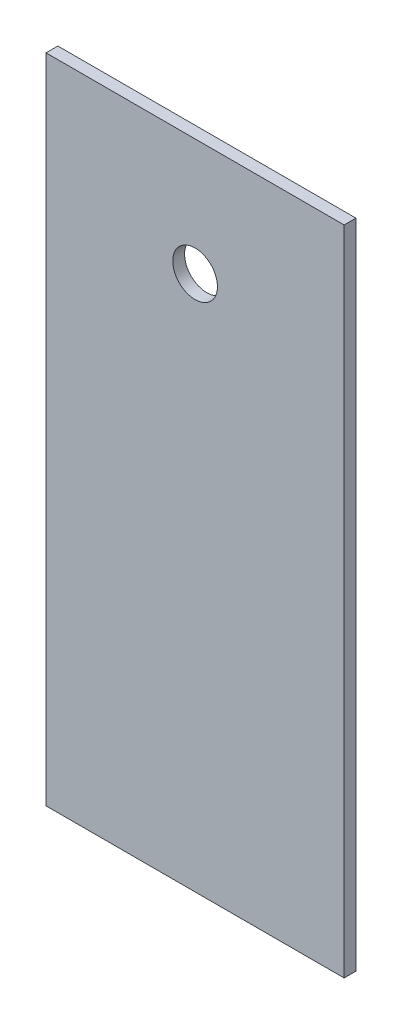
ISO-10303-21;
HEADER;
FILE_DESCRIPTION(('STEP AP214'),'2;1');
FILE_NAME('part.step','',(''),(''),'','','');
FILE_SCHEMA(('AUTOMOTIVE_DESIGN { 1 0 10303 214 1 1 1 1 }'));
ENDSEC;
DATA;
#1=APPLICATION_CONTEXT('core data for automotive mechanical design processes');
#2=APPLICATION_PROTOCOL_DEFINITION('international standard','automotive_design',2000,#1);
#3=PRODUCT_CONTEXT('',#1,'mechanical');
#4=PRODUCT('Part','Part','',(#3));
#5=PRODUCT_RELATED_PRODUCT_CATEGORY('part','',(#4));
#6=PRODUCT_DEFINITION_FORMATION('','',#4);
#7=PRODUCT_DEFINITION_CONTEXT('part definition',#1,'design');
#8=PRODUCT_DEFINITION('design','',#6,#7);
#9=PRODUCT_DEFINITION_SHAPE('','',#8);
#10=(LENGTH_UNIT() NAMED_UNIT(*) SI_UNIT(.MILLI.,.METRE.));
#11=(NAMED_UNIT(*) PLANE_ANGLE_UNIT() SI_UNIT($,.RADIAN.));
#12=(NAMED_UNIT(*) SI_UNIT($,.STERADIAN.) SOLID_ANGLE_UNIT());
#13=UNCERTAINTY_MEASURE_WITH_UNIT(LENGTH_MEASURE(1.E-05),#10,'distance_accuracy_value','');
#14=(GEOMETRIC_REPRESENTATION_CONTEXT(3) GLOBAL_UNCERTAINTY_ASSIGNED_CONTEXT((#13)) GLOBAL_UNIT_ASSIGNED_CONTEXT((#10,
#11,#12)) REPRESENTATION_CONTEXT('',''));
#15=CARTESIAN_POINT('',(0.,0.,0.));
#16=DIRECTION('',(0.,0.,1.));
#17=DIRECTION('',(1.,0.,0.));
#18=AXIS2_PLACEMENT_3D('',#15,#16,#17);
#19=CARTESIAN_POINT('',(40.,87.5,3.175));
#20=DIRECTION('',(-1.,0.,0.));
#21=DIRECTION('',(0.,-1.,0.));
#22=AXIS2_PLACEMENT_3D('',#19,#20,#21);
#23=PLANE('',#22);
#24=DIRECTION('',(0.,1.,0.));
#25=VECTOR('',#24,1.);
#26=CARTESIAN_POINT('',(40.,87.5,0.));
#27=LINE('',#26,#25);
#28=CARTESIAN_POINT('',(40.,-87.5,0.));
#29=VERTEX_POINT('',#28);
#30=CARTESIAN_POINT('',(40.,87.5,0.));
#31=VERTEX_POINT('',#30);
#32=EDGE_CURVE('E102',#29,#31,#27,.T.);
#33=ORIENTED_EDGE('',*,*,#32,.T.);
#34=DIRECTION('',(0.,0.,-1.));
#35=VECTOR('',#34,1.);
#36=CARTESIAN_POINT('',(40.,87.5,3.175));
#37=LINE('',#36,#35);
#38=CARTESIAN_POINT('',(40.,87.5,3.175));
#39=VERTEX_POINT('',#38);
#40=EDGE_CURVE('E11',#39,#31,#37,.T.);
#41=ORIENTED_EDGE('',*,*,#40,.F.);
#42=DIRECTION('',(0.,1.,0.));
#43=VECTOR('',#42,1.);
#44=CARTESIAN_POINT('',(40.,87.5,3.175));
#45=LINE('',#44,#43);
#46=CARTESIAN_POINT('',(40.,-87.5,3.175));
#47=VERTEX_POINT('',#46);
#48=EDGE_CURVE('E90',#47,#39,#45,.T.);
#49=ORIENTED_EDGE('',*,*,#48,.F.);
#50=DIRECTION('',(0.,0.,-1.));
#51=VECTOR('',#50,1.);
#52=CARTESIAN_POINT('',(40.,-87.5,3.175));
#53=LINE('',#52,#51);
#54=EDGE_CURVE('E98',#47,#29,#53,.T.);
#55=ORIENTED_EDGE('',*,*,#54,.T.);
#56=EDGE_LOOP('',(#33,#41,#49,#55));
#57=FACE_BOUND('',#56,.T.);
#58=ADVANCED_FACE('F39',(#57),#23,.F.);
#59=CARTESIAN_POINT('',(-40.,87.5,3.175));
#60=DIRECTION('',(0.,-1.,0.));
#61=DIRECTION('',(0.,0.,-1.));
#62=AXIS2_PLACEMENT_3D('',#59,#60,#61);
#63=PLANE('',#62);
#64=DIRECTION('',(-1.,0.,0.));
#65=VECTOR('',#64,1.);
#66=CARTESIAN_POINT('',(-40.,87.5,0.));
#67=LINE('',#66,#65);
#68=CARTESIAN_POINT('',(-40.,87.5,0.));
#69=VERTEX_POINT('',#68);
#70=EDGE_CURVE('E94',#31,#69,#67,.T.);
#71=ORIENTED_EDGE('',*,*,#70,.T.);
#72=DIRECTION('',(0.,0.,-1.));
#73=VECTOR('',#72,1.);
#74=CARTESIAN_POINT('',(-40.,87.5,3.175));
#75=LINE('',#74,#73);
#76=CARTESIAN_POINT('',(-40.,87.5,3.175));
#77=VERTEX_POINT('',#76);
#78=EDGE_CURVE('E47',#77,#69,#75,.T.);
#79=ORIENTED_EDGE('',*,*,#78,.F.);
#80=DIRECTION('',(-1.,0.,0.));
#81=VECTOR('',#80,1.);
#82=CARTESIAN_POINT('',(-40.,87.5,3.175));
#83=LINE('',#82,#81);
#84=EDGE_CURVE('E85',#39,#77,#83,.T.);
#85=ORIENTED_EDGE('',*,*,#84,.F.);
#86=ORIENTED_EDGE('',*,*,#40,.T.);
#87=EDGE_LOOP('',(#71,#79,#85,#86));
#88=FACE_BOUND('',#87,.T.);
#89=ADVANCED_FACE('F93',(#88),#63,.F.);
#90=CARTESIAN_POINT('',(-40.,87.5,3.175));
#91=DIRECTION('',(1.,0.,0.));
#92=DIRECTION('',(0.,1.,0.));
#93=AXIS2_PLACEMENT_3D('',#90,#91,#92);
#94=PLANE('',#93);
#95=DIRECTION('',(0.,-1.,0.));
#96=VECTOR('',#95,1.);
#97=CARTESIAN_POINT('',(-40.,87.5,0.));
#98=LINE('',#97,#96);
#99=CARTESIAN_POINT('',(-40.,-87.5,0.));
#100=VERTEX_POINT('',#99);
#101=EDGE_CURVE('E72',#69,#100,#98,.T.);
#102=ORIENTED_EDGE('',*,*,#101,.T.);
#103=DIRECTION('',(0.,0.,-1.));
#104=VECTOR('',#103,1.);
#105=CARTESIAN_POINT('',(-40.,-87.5,3.175));
#106=LINE('',#105,#104);
#107=CARTESIAN_POINT('',(-40.,-87.5,3.175));
#108=VERTEX_POINT('',#107);
#109=EDGE_CURVE('E95',#108,#100,#106,.T.);
#110=ORIENTED_EDGE('',*,*,#109,.F.);
#111=DIRECTION('',(0.,-1.,0.));
#112=VECTOR('',#111,1.);
#113=CARTESIAN_POINT('',(-40.,87.5,3.175));
#114=LINE('',#113,#112);
#115=EDGE_CURVE('E88',#77,#108,#114,.T.);
#116=ORIENTED_EDGE('',*,*,#115,.F.);
#117=ORIENTED_EDGE('',*,*,#78,.T.);
#118=EDGE_LOOP('',(#102,#110,#116,#117));
#119=FACE_BOUND('',#118,.T.);
#120=ADVANCED_FACE('F96',(#119),#94,.F.);
#121=CARTESIAN_POINT('',(-40.,-87.5,3.175));
#122=DIRECTION('',(0.,1.,0.));
#123=DIRECTION('',(0.,0.,1.));
#124=AXIS2_PLACEMENT_3D('',#121,#122,#123);
#125=PLANE('',#124);
#126=DIRECTION('',(1.,0.,0.));
#127=VECTOR('',#126,1.);
#128=CARTESIAN_POINT('',(-40.,-87.5,0.));
#129=LINE('',#128,#127);
#130=EDGE_CURVE('E78',#100,#29,#129,.T.);
#131=ORIENTED_EDGE('',*,*,#130,.T.);
#132=ORIENTED_EDGE('',*,*,#54,.F.);
#133=DIRECTION('',(1.,0.,0.));
#134=VECTOR('',#133,1.);
#135=CARTESIAN_POINT('',(-40.,-87.5,3.175));
#136=LINE('',#135,#134);
#137=EDGE_CURVE('E55',#108,#47,#136,.T.);
#138=ORIENTED_EDGE('',*,*,#137,.F.);
#139=ORIENTED_EDGE('',*,*,#109,.T.);
#140=EDGE_LOOP('',(#131,#132,#138,#139));
#141=FACE_BOUND('',#140,.T.);
#142=ADVANCED_FACE('F110',(#141),#125,.F.);
#143=CARTESIAN_POINT('',(0.,0.,3.175));
#144=DIRECTION('',(0.,0.,1.));
#145=DIRECTION('',(1.,0.,0.));
#146=AXIS2_PLACEMENT_3D('',#143,#144,#145);
#147=PLANE('',#146);
#148=CARTESIAN_POINT('',(0.,56.15,3.175));
#149=DIRECTION('',(0.,0.,1.));
#150=DIRECTION('',(1.,0.,0.));
#151=AXIS2_PLACEMENT_3D('',#148,#149,#150);
#152=CIRCLE('',#151,6.);
#153=CARTESIAN_POINT('',(6.,56.15,3.175));
#154=VERTEX_POINT('',#153);
#155=EDGE_CURVE('E118',#154,#154,#152,.T.);
#156=ORIENTED_EDGE('',*,*,#155,.F.);
#157=EDGE_LOOP('',(#156));
#158=FACE_BOUND('',#157,.T.);
#159=ORIENTED_EDGE('',*,*,#48,.T.);
#160=ORIENTED_EDGE('',*,*,#84,.T.);
#161=ORIENTED_EDGE('',*,*,#115,.T.);
#162=ORIENTED_EDGE('',*,*,#137,.T.);
#163=EDGE_LOOP('',(#159,#160,#161,#162));
#164=FACE_BOUND('',#163,.T.);
#165=ADVANCED_FACE('F86',(#158,#164),#147,.T.);
#166=CARTESIAN_POINT('',(0.,0.,0.));
#167=DIRECTION('',(0.,0.,1.));
#168=DIRECTION('',(1.,0.,0.));
#169=AXIS2_PLACEMENT_3D('',#166,#167,#168);
#170=PLANE('',#169);
#171=CARTESIAN_POINT('',(0.,56.15,0.));
#172=DIRECTION('',(0.,0.,1.));
#173=DIRECTION('',(1.,0.,0.));
#174=AXIS2_PLACEMENT_3D('',#171,#172,#173);
#175=CIRCLE('',#174,6.);
#176=CARTESIAN_POINT('',(6.,56.15,0.));
#177=VERTEX_POINT('',#176);
#178=EDGE_CURVE('E105',#177,#177,#175,.T.);
#179=ORIENTED_EDGE('',*,*,#178,.T.);
#180=EDGE_LOOP('',(#179));
#181=FACE_BOUND('',#180,.T.);
#182=ORIENTED_EDGE('',*,*,#32,.F.);
#183=ORIENTED_EDGE('',*,*,#130,.F.);
#184=ORIENTED_EDGE('',*,*,#101,.F.);
#185=ORIENTED_EDGE('',*,*,#70,.F.);
#186=EDGE_LOOP('',(#182,#183,#184,#185));
#187=FACE_BOUND('',#186,.T.);
#188=ADVANCED_FACE('F113',(#181,#187),#170,.F.);
#189=CARTESIAN_POINT('',(0.,56.15,3.175));
#190=DIRECTION('',(0.,0.,1.));
#191=DIRECTION('',(1.,0.,0.));
#192=AXIS2_PLACEMENT_3D('',#189,#190,#191);
#193=CYLINDRICAL_SURFACE('',#192,6.);
#194=ORIENTED_EDGE('',*,*,#178,.F.);
#195=EDGE_LOOP('',(#194));
#196=FACE_BOUND('',#195,.T.);
#197=ORIENTED_EDGE('',*,*,#155,.T.);
#198=EDGE_LOOP('',(#197));
#199=FACE_BOUND('',#198,.T.);
#200=ADVANCED_FACE('F122',(#196,#199),#193,.F.);
#201=CLOSED_SHELL('',(#58,#89,#120,#142,#165,#188,#200));
#202=MANIFOLD_SOLID_BREP('B2',#201);
#203=ADVANCED_BREP_SHAPE_REPRESENTATION('',(#18,#202),#14);
#204=SHAPE_DEFINITION_REPRESENTATION(#9,#203);
ENDSEC;
END-ISO-10303-21;
